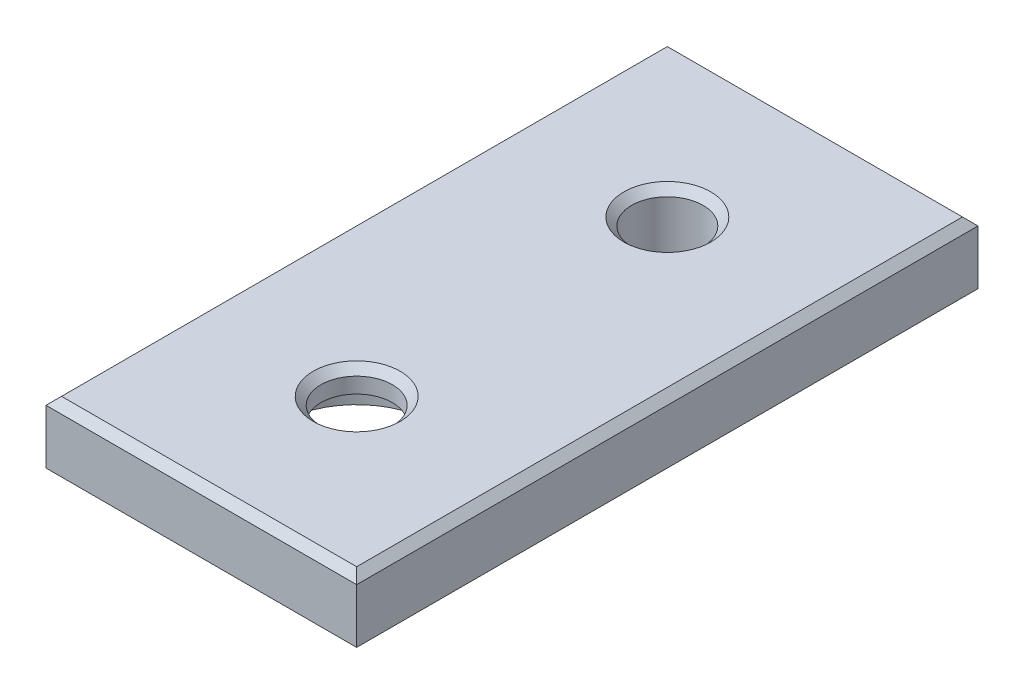
ISO-10303-21;
HEADER;
FILE_DESCRIPTION(('STEP AP214'),'2;1');
FILE_NAME('part.step','',(''),(''),'','','');
FILE_SCHEMA(('AUTOMOTIVE_DESIGN { 1 0 10303 214 1 1 1 1 }'));
ENDSEC;
DATA;
#1=APPLICATION_CONTEXT('core data for automotive mechanical design processes');
#2=APPLICATION_PROTOCOL_DEFINITION('international standard','automotive_design',2000,#1);
#3=PRODUCT_CONTEXT('',#1,'mechanical');
#4=PRODUCT('Part','Part','',(#3));
#5=PRODUCT_RELATED_PRODUCT_CATEGORY('part','',(#4));
#6=PRODUCT_DEFINITION_FORMATION('','',#4);
#7=PRODUCT_DEFINITION_CONTEXT('part definition',#1,'design');
#8=PRODUCT_DEFINITION('design','',#6,#7);
#9=PRODUCT_DEFINITION_SHAPE('','',#8);
#10=(LENGTH_UNIT() NAMED_UNIT(*) SI_UNIT(.MILLI.,.METRE.));
#11=(NAMED_UNIT(*) PLANE_ANGLE_UNIT() SI_UNIT($,.RADIAN.));
#12=(NAMED_UNIT(*) SI_UNIT($,.STERADIAN.) SOLID_ANGLE_UNIT());
#13=UNCERTAINTY_MEASURE_WITH_UNIT(LENGTH_MEASURE(1.E-05),#10,'distance_accuracy_value','');
#14=(GEOMETRIC_REPRESENTATION_CONTEXT(3) GLOBAL_UNCERTAINTY_ASSIGNED_CONTEXT((#13)) GLOBAL_UNIT_ASSIGNED_CONTEXT((#10,
#11,#12)) REPRESENTATION_CONTEXT('',''));
#15=CARTESIAN_POINT('',(0.,0.,0.));
#16=DIRECTION('',(0.,0.,1.));
#17=DIRECTION('',(1.,0.,0.));
#18=AXIS2_PLACEMENT_3D('',#15,#16,#17);
#19=CARTESIAN_POINT('',(0.,0.,10.));
#20=DIRECTION('',(0.,1.,0.));
#21=DIRECTION('',(0.,0.,1.));
#22=AXIS2_PLACEMENT_3D('',#19,#20,#21);
#23=CYLINDRICAL_SURFACE('',#22,2.3);
#24=CARTESIAN_POINT('',(0.,3.50000000000001,10.));
#25=DIRECTION('',(0.,1.,0.));
#26=DIRECTION('',(0.,0.,1.));
#27=AXIS2_PLACEMENT_3D('',#24,#25,#26);
#28=CIRCLE('',#27,2.3);
#29=CARTESIAN_POINT('',(0.,3.50000000000001,12.3));
#30=VERTEX_POINT('',#29);
#31=EDGE_CURVE('E11',#30,#30,#28,.T.);
#32=ORIENTED_EDGE('',*,*,#31,.T.);
#33=EDGE_LOOP('',(#32));
#34=FACE_BOUND('',#33,.T.);
#35=CARTESIAN_POINT('',(0.,2.5,10.));
#36=DIRECTION('',(0.,-1.,0.));
#37=DIRECTION('',(0.,0.,-1.));
#38=AXIS2_PLACEMENT_3D('',#35,#36,#37);
#39=CIRCLE('',#38,2.3);
#40=CARTESIAN_POINT('',(0.,2.5,7.7));
#41=VERTEX_POINT('',#40);
#42=EDGE_CURVE('E40',#41,#41,#39,.F.);
#43=ORIENTED_EDGE('',*,*,#42,.F.);
#44=EDGE_LOOP('',(#43));
#45=FACE_BOUND('',#44,.T.);
#46=ADVANCED_FACE('F36',(#34,#45),#23,.F.);
#47=CARTESIAN_POINT('',(0.,0.,0.));
#48=DIRECTION('',(0.,1.,0.));
#49=DIRECTION('',(0.,0.,1.));
#50=AXIS2_PLACEMENT_3D('',#47,#48,#49);
#51=PLANE('',#50);
#52=CARTESIAN_POINT('',(0.,0.,10.));
#53=DIRECTION('',(0.,-1.,0.));
#54=DIRECTION('',(0.,0.,-1.));
#55=AXIS2_PLACEMENT_3D('',#52,#53,#54);
#56=CIRCLE('',#55,5.);
#57=CARTESIAN_POINT('',(0.,0.,5.));
#58=VERTEX_POINT('',#57);
#59=EDGE_CURVE('E317',#58,#58,#56,.T.);
#60=ORIENTED_EDGE('',*,*,#59,.F.);
#61=EDGE_LOOP('',(#60));
#62=FACE_BOUND('',#61,.T.);
#63=DIRECTION('',(1.,0.,0.));
#64=VECTOR('',#63,1.);
#65=CARTESIAN_POINT('',(0.,0.,-13.));
#66=LINE('',#65,#64);
#67=CARTESIAN_POINT('',(-2.95,0.,-13.));
#68=VERTEX_POINT('',#67);
#69=CARTESIAN_POINT('',(2.95,0.,-13.));
#70=VERTEX_POINT('',#69);
#71=EDGE_CURVE('E172',#68,#70,#66,.T.);
#72=ORIENTED_EDGE('',*,*,#71,.T.);
#73=DIRECTION('',(0.,0.,-1.));
#74=VECTOR('',#73,1.);
#75=CARTESIAN_POINT('',(2.95,0.,0.));
#76=LINE('',#75,#74);
#77=CARTESIAN_POINT('',(2.95,0.,-20.));
#78=VERTEX_POINT('',#77);
#79=EDGE_CURVE('E145',#70,#78,#76,.T.);
#80=ORIENTED_EDGE('',*,*,#79,.T.);
#81=DIRECTION('',(-1.,0.,0.));
#82=VECTOR('',#81,1.);
#83=CARTESIAN_POINT('',(-10.,0.,-20.));
#84=LINE('',#83,#82);
#85=CARTESIAN_POINT('',(10.,0.,-20.));
#86=VERTEX_POINT('',#85);
#87=EDGE_CURVE('E219',#86,#78,#84,.T.);
#88=ORIENTED_EDGE('',*,*,#87,.F.);
#89=DIRECTION('',(0.,0.,-1.));
#90=VECTOR('',#89,1.);
#91=CARTESIAN_POINT('',(10.,0.,-20.));
#92=LINE('',#91,#90);
#93=CARTESIAN_POINT('',(10.,0.,20.));
#94=VERTEX_POINT('',#93);
#95=EDGE_CURVE('E215',#94,#86,#92,.T.);
#96=ORIENTED_EDGE('',*,*,#95,.F.);
#97=DIRECTION('',(1.,0.,0.));
#98=VECTOR('',#97,1.);
#99=CARTESIAN_POINT('',(-10.,0.,20.));
#100=LINE('',#99,#98);
#101=CARTESIAN_POINT('',(-10.,0.,20.));
#102=VERTEX_POINT('',#101);
#103=EDGE_CURVE('E225',#102,#94,#100,.T.);
#104=ORIENTED_EDGE('',*,*,#103,.F.);
#105=DIRECTION('',(0.,0.,1.));
#106=VECTOR('',#105,1.);
#107=CARTESIAN_POINT('',(-10.,0.,-20.));
#108=LINE('',#107,#106);
#109=CARTESIAN_POINT('',(-10.,0.,-20.));
#110=VERTEX_POINT('',#109);
#111=EDGE_CURVE('E222',#110,#102,#108,.T.);
#112=ORIENTED_EDGE('',*,*,#111,.F.);
#113=CARTESIAN_POINT('',(-2.95,0.,-20.));
#114=VERTEX_POINT('',#113);
#115=EDGE_CURVE('E218',#114,#110,#84,.T.);
#116=ORIENTED_EDGE('',*,*,#115,.F.);
#117=DIRECTION('',(0.,0.,-1.));
#118=VECTOR('',#117,1.);
#119=CARTESIAN_POINT('',(-2.95,0.,0.));
#120=LINE('',#119,#118);
#121=EDGE_CURVE('E160',#68,#114,#120,.T.);
#122=ORIENTED_EDGE('',*,*,#121,.F.);
#123=EDGE_LOOP('',(#72,#80,#88,#96,#104,#112,#116,#122));
#124=FACE_BOUND('',#123,.T.);
#125=CARTESIAN_POINT('',(0.,0.,-10.));
#126=DIRECTION('',(0.,1.,0.));
#127=DIRECTION('',(0.,0.,1.));
#128=AXIS2_PLACEMENT_3D('',#125,#126,#127);
#129=CIRCLE('',#128,2.3);
#130=CARTESIAN_POINT('',(0.,0.,-7.7));
#131=VERTEX_POINT('',#130);
#132=EDGE_CURVE('E212',#131,#131,#129,.T.);
#133=ORIENTED_EDGE('',*,*,#132,.T.);
#134=EDGE_LOOP('',(#133));
#135=FACE_BOUND('',#134,.T.);
#136=DIRECTION('',(1.,0.,0.));
#137=VECTOR('',#136,1.);
#138=CARTESIAN_POINT('',(0.,0.,-7.));
#139=LINE('',#138,#137);
#140=CARTESIAN_POINT('',(-2.95,0.,-7.));
#141=VERTEX_POINT('',#140);
#142=CARTESIAN_POINT('',(2.95,0.,-7.));
#143=VERTEX_POINT('',#142);
#144=EDGE_CURVE('E150',#141,#143,#139,.T.);
#145=ORIENTED_EDGE('',*,*,#144,.F.);
#146=DIRECTION('',(0.,0.,1.));
#147=VECTOR('',#146,1.);
#148=CARTESIAN_POINT('',(-2.95,0.,0.));
#149=LINE('',#148,#147);
#150=CARTESIAN_POINT('',(-2.95,0.,-1.));
#151=VERTEX_POINT('',#150);
#152=EDGE_CURVE('E185',#141,#151,#149,.T.);
#153=ORIENTED_EDGE('',*,*,#152,.T.);
#154=DIRECTION('',(1.,0.,0.));
#155=VECTOR('',#154,1.);
#156=CARTESIAN_POINT('',(0.,0.,-1.));
#157=LINE('',#156,#155);
#158=CARTESIAN_POINT('',(2.95,0.,-1.));
#159=VERTEX_POINT('',#158);
#160=EDGE_CURVE('E199',#151,#159,#157,.T.);
#161=ORIENTED_EDGE('',*,*,#160,.T.);
#162=DIRECTION('',(0.,0.,1.));
#163=VECTOR('',#162,1.);
#164=CARTESIAN_POINT('',(2.95,0.,0.));
#165=LINE('',#164,#163);
#166=EDGE_CURVE('E196',#143,#159,#165,.T.);
#167=ORIENTED_EDGE('',*,*,#166,.F.);
#168=EDGE_LOOP('',(#145,#153,#161,#167));
#169=FACE_BOUND('',#168,.T.);
#170=ADVANCED_FACE('F310',(#62,#124,#135,#169),#51,.F.);
#171=CARTESIAN_POINT('',(10.,4.,-20.));
#172=DIRECTION('',(-1.,0.,0.));
#173=DIRECTION('',(0.,0.,1.));
#174=AXIS2_PLACEMENT_3D('',#171,#172,#173);
#175=PLANE('',#174);
#176=DIRECTION('',(0.,-1.,0.));
#177=VECTOR('',#176,1.);
#178=CARTESIAN_POINT('',(10.,4.,-20.));
#179=LINE('',#178,#177);
#180=CARTESIAN_POINT('',(10.,3.50000000000001,-20.));
#181=VERTEX_POINT('',#180);
#182=EDGE_CURVE('E234',#181,#86,#179,.T.);
#183=ORIENTED_EDGE('',*,*,#182,.F.);
#184=DIRECTION('',(0.,0.,1.));
#185=VECTOR('',#184,1.);
#186=CARTESIAN_POINT('',(10.,3.50000000000001,20.));
#187=LINE('',#186,#185);
#188=CARTESIAN_POINT('',(10.,3.50000000000001,20.));
#189=VERTEX_POINT('',#188);
#190=EDGE_CURVE('E256',#181,#189,#187,.T.);
#191=ORIENTED_EDGE('',*,*,#190,.T.);
#192=DIRECTION('',(0.,-1.,0.));
#193=VECTOR('',#192,1.);
#194=CARTESIAN_POINT('',(10.,4.,20.));
#195=LINE('',#194,#193);
#196=EDGE_CURVE('E228',#189,#94,#195,.T.);
#197=ORIENTED_EDGE('',*,*,#196,.T.);
#198=ORIENTED_EDGE('',*,*,#95,.T.);
#199=EDGE_LOOP('',(#183,#191,#197,#198));
#200=FACE_BOUND('',#199,.T.);
#201=ADVANCED_FACE('F283',(#200),#175,.F.);
#202=CARTESIAN_POINT('',(-10.,4.,-20.));
#203=DIRECTION('',(0.,0.,1.));
#204=DIRECTION('',(1.,0.,0.));
#205=AXIS2_PLACEMENT_3D('',#202,#203,#204);
#206=PLANE('',#205);
#207=DIRECTION('',(0.,-1.,0.));
#208=VECTOR('',#207,1.);
#209=CARTESIAN_POINT('',(-10.,4.,-20.));
#210=LINE('',#209,#208);
#211=CARTESIAN_POINT('',(-10.,3.50000000000001,-20.));
#212=VERTEX_POINT('',#211);
#213=EDGE_CURVE('E232',#212,#110,#210,.T.);
#214=ORIENTED_EDGE('',*,*,#213,.F.);
#215=DIRECTION('',(1.,0.,0.));
#216=VECTOR('',#215,1.);
#217=CARTESIAN_POINT('',(10.,3.50000000000001,-20.));
#218=LINE('',#217,#216);
#219=EDGE_CURVE('E53',#212,#181,#218,.T.);
#220=ORIENTED_EDGE('',*,*,#219,.T.);
#221=ORIENTED_EDGE('',*,*,#182,.T.);
#222=ORIENTED_EDGE('',*,*,#87,.T.);
#223=DIRECTION('',(0.,1.,0.));
#224=VECTOR('',#223,1.);
#225=CARTESIAN_POINT('',(2.95,-2.,-20.));
#226=LINE('',#225,#224);
#227=CARTESIAN_POINT('',(2.95,-2.,-20.));
#228=VERTEX_POINT('',#227);
#229=EDGE_CURVE('E170',#228,#78,#226,.T.);
#230=ORIENTED_EDGE('',*,*,#229,.F.);
#231=DIRECTION('',(1.,0.,0.));
#232=VECTOR('',#231,1.);
#233=CARTESIAN_POINT('',(0.,-2.,-20.));
#234=LINE('',#233,#232);
#235=CARTESIAN_POINT('',(-2.95,-2.,-20.));
#236=VERTEX_POINT('',#235);
#237=EDGE_CURVE('E158',#236,#228,#234,.T.);
#238=ORIENTED_EDGE('',*,*,#237,.F.);
#239=DIRECTION('',(0.,1.,0.));
#240=VECTOR('',#239,1.);
#241=CARTESIAN_POINT('',(-2.95,-2.,-20.));
#242=LINE('',#241,#240);
#243=EDGE_CURVE('E178',#236,#114,#242,.T.);
#244=ORIENTED_EDGE('',*,*,#243,.T.);
#245=ORIENTED_EDGE('',*,*,#115,.T.);
#246=EDGE_LOOP('',(#214,#220,#221,#222,#230,#238,#244,#245));
#247=FACE_BOUND('',#246,.T.);
#248=ADVANCED_FACE('F369',(#247),#206,.F.);
#249=CARTESIAN_POINT('',(-10.,4.,-20.));
#250=DIRECTION('',(1.,0.,0.));
#251=DIRECTION('',(0.,0.,-1.));
#252=AXIS2_PLACEMENT_3D('',#249,#250,#251);
#253=PLANE('',#252);
#254=DIRECTION('',(0.,-1.,0.));
#255=VECTOR('',#254,1.);
#256=CARTESIAN_POINT('',(-10.,4.,20.));
#257=LINE('',#256,#255);
#258=CARTESIAN_POINT('',(-10.,3.50000000000001,20.));
#259=VERTEX_POINT('',#258);
#260=EDGE_CURVE('E230',#259,#102,#257,.T.);
#261=ORIENTED_EDGE('',*,*,#260,.F.);
#262=DIRECTION('',(0.,0.,-1.));
#263=VECTOR('',#262,1.);
#264=CARTESIAN_POINT('',(-10.,3.50000000000001,-20.));
#265=LINE('',#264,#263);
#266=EDGE_CURVE('E61',#259,#212,#265,.T.);
#267=ORIENTED_EDGE('',*,*,#266,.T.);
#268=ORIENTED_EDGE('',*,*,#213,.T.);
#269=ORIENTED_EDGE('',*,*,#111,.T.);
#270=EDGE_LOOP('',(#261,#267,#268,#269));
#271=FACE_BOUND('',#270,.T.);
#272=ADVANCED_FACE('F366',(#271),#253,.F.);
#273=CARTESIAN_POINT('',(-10.,4.,20.));
#274=DIRECTION('',(0.,0.,-1.));
#275=DIRECTION('',(-1.,0.,0.));
#276=AXIS2_PLACEMENT_3D('',#273,#274,#275);
#277=PLANE('',#276);
#278=ORIENTED_EDGE('',*,*,#196,.F.);
#279=DIRECTION('',(-1.,0.,0.));
#280=VECTOR('',#279,1.);
#281=CARTESIAN_POINT('',(-10.,3.50000000000001,20.));
#282=LINE('',#281,#280);
#283=EDGE_CURVE('E251',#189,#259,#282,.T.);
#284=ORIENTED_EDGE('',*,*,#283,.T.);
#285=ORIENTED_EDGE('',*,*,#260,.T.);
#286=ORIENTED_EDGE('',*,*,#103,.T.);
#287=EDGE_LOOP('',(#278,#284,#285,#286));
#288=FACE_BOUND('',#287,.T.);
#289=ADVANCED_FACE('F286',(#288),#277,.F.);
#290=CARTESIAN_POINT('',(0.,4.,0.));
#291=DIRECTION('',(0.,1.,0.));
#292=DIRECTION('',(0.,0.,1.));
#293=AXIS2_PLACEMENT_3D('',#290,#291,#292);
#294=PLANE('',#293);
#295=DIRECTION('',(0.,0.,1.));
#296=VECTOR('',#295,1.);
#297=CARTESIAN_POINT('',(-9.5,4.,20.));
#298=LINE('',#297,#296);
#299=CARTESIAN_POINT('',(-9.50000000000001,4.,-19.5));
#300=VERTEX_POINT('',#299);
#301=CARTESIAN_POINT('',(-9.5,4.,19.5));
#302=VERTEX_POINT('',#301);
#303=EDGE_CURVE('E246',#300,#302,#298,.T.);
#304=ORIENTED_EDGE('',*,*,#303,.T.);
#305=DIRECTION('',(1.,0.,0.));
#306=VECTOR('',#305,1.);
#307=CARTESIAN_POINT('',(10.,4.,19.5));
#308=LINE('',#307,#306);
#309=CARTESIAN_POINT('',(9.50000000000001,4.,19.5));
#310=VERTEX_POINT('',#309);
#311=EDGE_CURVE('E248',#302,#310,#308,.T.);
#312=ORIENTED_EDGE('',*,*,#311,.T.);
#313=DIRECTION('',(0.,0.,-1.));
#314=VECTOR('',#313,1.);
#315=CARTESIAN_POINT('',(9.50000000000001,4.,-20.));
#316=LINE('',#315,#314);
#317=CARTESIAN_POINT('',(9.50000000000001,4.,-19.5));
#318=VERTEX_POINT('',#317);
#319=EDGE_CURVE('E242',#310,#318,#316,.T.);
#320=ORIENTED_EDGE('',*,*,#319,.T.);
#321=DIRECTION('',(-1.,0.,0.));
#322=VECTOR('',#321,1.);
#323=CARTESIAN_POINT('',(-10.,4.,-19.5));
#324=LINE('',#323,#322);
#325=EDGE_CURVE('E244',#318,#300,#324,.T.);
#326=ORIENTED_EDGE('',*,*,#325,.T.);
#327=EDGE_LOOP('',(#304,#312,#320,#326));
#328=FACE_BOUND('',#327,.T.);
#329=CARTESIAN_POINT('',(0.,4.,-10.));
#330=DIRECTION('',(0.,1.,0.));
#331=DIRECTION('',(0.,0.,1.));
#332=AXIS2_PLACEMENT_3D('',#329,#330,#331);
#333=CIRCLE('',#332,2.8);
#334=CARTESIAN_POINT('',(0.,4.,-7.20000000000001));
#335=VERTEX_POINT('',#334);
#336=EDGE_CURVE('E239',#335,#335,#333,.F.);
#337=ORIENTED_EDGE('',*,*,#336,.T.);
#338=EDGE_LOOP('',(#337));
#339=FACE_BOUND('',#338,.T.);
#340=CARTESIAN_POINT('',(0.,4.,10.));
#341=DIRECTION('',(0.,1.,0.));
#342=DIRECTION('',(0.,0.,1.));
#343=AXIS2_PLACEMENT_3D('',#340,#341,#342);
#344=CIRCLE('',#343,2.79999999999999);
#345=CARTESIAN_POINT('',(0.,4.,12.8));
#346=VERTEX_POINT('',#345);
#347=EDGE_CURVE('E236',#346,#346,#344,.F.);
#348=ORIENTED_EDGE('',*,*,#347,.T.);
#349=EDGE_LOOP('',(#348));
#350=FACE_BOUND('',#349,.T.);
#351=ADVANCED_FACE('F293',(#328,#339,#350),#294,.T.);
#352=CARTESIAN_POINT('',(0.,0.,-10.));
#353=DIRECTION('',(0.,1.,0.));
#354=DIRECTION('',(0.,0.,1.));
#355=AXIS2_PLACEMENT_3D('',#352,#353,#354);
#356=CYLINDRICAL_SURFACE('',#355,2.3);
#357=CARTESIAN_POINT('',(0.,3.5,-10.));
#358=DIRECTION('',(0.,1.,0.));
#359=DIRECTION('',(0.,0.,1.));
#360=AXIS2_PLACEMENT_3D('',#357,#358,#359);
#361=CIRCLE('',#360,2.3);
#362=CARTESIAN_POINT('',(0.,3.5,-7.7));
#363=VERTEX_POINT('',#362);
#364=EDGE_CURVE('E45',#363,#363,#361,.T.);
#365=ORIENTED_EDGE('',*,*,#364,.T.);
#366=EDGE_LOOP('',(#365));
#367=FACE_BOUND('',#366,.T.);
#368=ORIENTED_EDGE('',*,*,#132,.F.);
#369=EDGE_LOOP('',(#368));
#370=FACE_BOUND('',#369,.T.);
#371=ADVANCED_FACE('F296',(#367,#370),#356,.F.);
#372=CARTESIAN_POINT('',(0.,-2.,-7.));
#373=DIRECTION('',(0.,0.,1.));
#374=DIRECTION('',(1.,0.,0.));
#375=AXIS2_PLACEMENT_3D('',#372,#373,#374);
#376=PLANE('',#375);
#377=ORIENTED_EDGE('',*,*,#144,.T.);
#378=DIRECTION('',(0.,1.,0.));
#379=VECTOR('',#378,1.);
#380=CARTESIAN_POINT('',(2.95,-2.,-7.));
#381=LINE('',#380,#379);
#382=CARTESIAN_POINT('',(2.95,-2.,-7.));
#383=VERTEX_POINT('',#382);
#384=EDGE_CURVE('E210',#383,#143,#381,.T.);
#385=ORIENTED_EDGE('',*,*,#384,.F.);
#386=DIRECTION('',(1.,0.,0.));
#387=VECTOR('',#386,1.);
#388=CARTESIAN_POINT('',(0.,-2.,-7.));
#389=LINE('',#388,#387);
#390=CARTESIAN_POINT('',(-2.95,-2.,-7.));
#391=VERTEX_POINT('',#390);
#392=EDGE_CURVE('E181',#391,#383,#389,.T.);
#393=ORIENTED_EDGE('',*,*,#392,.F.);
#394=DIRECTION('',(0.,1.,0.));
#395=VECTOR('',#394,1.);
#396=CARTESIAN_POINT('',(-2.95,-2.,-7.));
#397=LINE('',#396,#395);
#398=EDGE_CURVE('E193',#391,#141,#397,.T.);
#399=ORIENTED_EDGE('',*,*,#398,.T.);
#400=EDGE_LOOP('',(#377,#385,#393,#399));
#401=FACE_BOUND('',#400,.T.);
#402=ADVANCED_FACE('F338',(#401),#376,.F.);
#403=CARTESIAN_POINT('',(2.95,-2.,0.));
#404=DIRECTION('',(-1.,0.,0.));
#405=DIRECTION('',(0.,0.,1.));
#406=AXIS2_PLACEMENT_3D('',#403,#404,#405);
#407=PLANE('',#406);
#408=ORIENTED_EDGE('',*,*,#166,.T.);
#409=DIRECTION('',(0.,1.,0.));
#410=VECTOR('',#409,1.);
#411=CARTESIAN_POINT('',(2.95,-2.,-1.));
#412=LINE('',#411,#410);
#413=CARTESIAN_POINT('',(2.95,-2.,-1.));
#414=VERTEX_POINT('',#413);
#415=EDGE_CURVE('E208',#414,#159,#412,.T.);
#416=ORIENTED_EDGE('',*,*,#415,.F.);
#417=DIRECTION('',(0.,0.,1.));
#418=VECTOR('',#417,1.);
#419=CARTESIAN_POINT('',(2.95,-2.,0.));
#420=LINE('',#419,#418);
#421=EDGE_CURVE('E184',#383,#414,#420,.T.);
#422=ORIENTED_EDGE('',*,*,#421,.F.);
#423=ORIENTED_EDGE('',*,*,#384,.T.);
#424=EDGE_LOOP('',(#408,#416,#422,#423));
#425=FACE_BOUND('',#424,.T.);
#426=ADVANCED_FACE('F350',(#425),#407,.F.);
#427=CARTESIAN_POINT('',(0.,-2.,-1.));
#428=DIRECTION('',(0.,0.,1.));
#429=DIRECTION('',(1.,0.,0.));
#430=AXIS2_PLACEMENT_3D('',#427,#428,#429);
#431=PLANE('',#430);
#432=ORIENTED_EDGE('',*,*,#160,.F.);
#433=DIRECTION('',(0.,1.,0.));
#434=VECTOR('',#433,1.);
#435=CARTESIAN_POINT('',(-2.95,-2.,-1.));
#436=LINE('',#435,#434);
#437=CARTESIAN_POINT('',(-2.95,-2.,-1.));
#438=VERTEX_POINT('',#437);
#439=EDGE_CURVE('E205',#438,#151,#436,.T.);
#440=ORIENTED_EDGE('',*,*,#439,.F.);
#441=DIRECTION('',(1.,0.,0.));
#442=VECTOR('',#441,1.);
#443=CARTESIAN_POINT('',(0.,-2.,-1.));
#444=LINE('',#443,#442);
#445=EDGE_CURVE('E187',#438,#414,#444,.T.);
#446=ORIENTED_EDGE('',*,*,#445,.T.);
#447=ORIENTED_EDGE('',*,*,#415,.T.);
#448=EDGE_LOOP('',(#432,#440,#446,#447));
#449=FACE_BOUND('',#448,.T.);
#450=ADVANCED_FACE('F345',(#449),#431,.T.);
#451=CARTESIAN_POINT('',(-2.95,-2.,0.));
#452=DIRECTION('',(-1.,0.,0.));
#453=DIRECTION('',(0.,0.,1.));
#454=AXIS2_PLACEMENT_3D('',#451,#452,#453);
#455=PLANE('',#454);
#456=ORIENTED_EDGE('',*,*,#152,.F.);
#457=ORIENTED_EDGE('',*,*,#398,.F.);
#458=DIRECTION('',(0.,0.,1.));
#459=VECTOR('',#458,1.);
#460=CARTESIAN_POINT('',(-2.95,-2.,0.));
#461=LINE('',#460,#459);
#462=EDGE_CURVE('E190',#391,#438,#461,.T.);
#463=ORIENTED_EDGE('',*,*,#462,.T.);
#464=ORIENTED_EDGE('',*,*,#439,.T.);
#465=EDGE_LOOP('',(#456,#457,#463,#464));
#466=FACE_BOUND('',#465,.T.);
#467=ADVANCED_FACE('F342',(#466),#455,.T.);
#468=CARTESIAN_POINT('',(0.,-2.,0.));
#469=DIRECTION('',(0.,-1.,0.));
#470=DIRECTION('',(0.,0.,-1.));
#471=AXIS2_PLACEMENT_3D('',#468,#469,#470);
#472=PLANE('',#471);
#473=ORIENTED_EDGE('',*,*,#392,.T.);
#474=ORIENTED_EDGE('',*,*,#421,.T.);
#475=ORIENTED_EDGE('',*,*,#445,.F.);
#476=ORIENTED_EDGE('',*,*,#462,.F.);
#477=EDGE_LOOP('',(#473,#474,#475,#476));
#478=FACE_BOUND('',#477,.T.);
#479=ADVANCED_FACE('F347',(#478),#472,.T.);
#480=CARTESIAN_POINT('',(2.95,-2.,0.));
#481=DIRECTION('',(1.,0.,0.));
#482=DIRECTION('',(0.,0.,-1.));
#483=AXIS2_PLACEMENT_3D('',#480,#481,#482);
#484=PLANE('',#483);
#485=ORIENTED_EDGE('',*,*,#79,.F.);
#486=DIRECTION('',(0.,1.,0.));
#487=VECTOR('',#486,1.);
#488=CARTESIAN_POINT('',(2.95,-2.,-13.));
#489=LINE('',#488,#487);
#490=CARTESIAN_POINT('',(2.95,-2.,-13.));
#491=VERTEX_POINT('',#490);
#492=EDGE_CURVE('E140',#491,#70,#489,.T.);
#493=ORIENTED_EDGE('',*,*,#492,.F.);
#494=DIRECTION('',(0.,0.,-1.));
#495=VECTOR('',#494,1.);
#496=CARTESIAN_POINT('',(2.95,-2.,0.));
#497=LINE('',#496,#495);
#498=EDGE_CURVE('E143',#491,#228,#497,.T.);
#499=ORIENTED_EDGE('',*,*,#498,.T.);
#500=ORIENTED_EDGE('',*,*,#229,.T.);
#501=EDGE_LOOP('',(#485,#493,#499,#500));
#502=FACE_BOUND('',#501,.T.);
#503=ADVANCED_FACE('F142',(#502),#484,.T.);
#504=CARTESIAN_POINT('',(0.,-2.,-13.));
#505=DIRECTION('',(0.,0.,1.));
#506=DIRECTION('',(1.,0.,0.));
#507=AXIS2_PLACEMENT_3D('',#504,#505,#506);
#508=PLANE('',#507);
#509=ORIENTED_EDGE('',*,*,#71,.F.);
#510=DIRECTION('',(0.,1.,0.));
#511=VECTOR('',#510,1.);
#512=CARTESIAN_POINT('',(-2.95,-2.,-13.));
#513=LINE('',#512,#511);
#514=CARTESIAN_POINT('',(-2.95,-2.,-13.));
#515=VERTEX_POINT('',#514);
#516=EDGE_CURVE('E151',#515,#68,#513,.T.);
#517=ORIENTED_EDGE('',*,*,#516,.F.);
#518=DIRECTION('',(1.,0.,0.));
#519=VECTOR('',#518,1.);
#520=CARTESIAN_POINT('',(0.,-2.,-13.));
#521=LINE('',#520,#519);
#522=EDGE_CURVE('E156',#515,#491,#521,.T.);
#523=ORIENTED_EDGE('',*,*,#522,.T.);
#524=ORIENTED_EDGE('',*,*,#492,.T.);
#525=EDGE_LOOP('',(#509,#517,#523,#524));
#526=FACE_BOUND('',#525,.T.);
#527=ADVANCED_FACE('F162',(#526),#508,.T.);
#528=CARTESIAN_POINT('',(-2.95,-2.,0.));
#529=DIRECTION('',(1.,0.,0.));
#530=DIRECTION('',(0.,0.,-1.));
#531=AXIS2_PLACEMENT_3D('',#528,#529,#530);
#532=PLANE('',#531);
#533=ORIENTED_EDGE('',*,*,#121,.T.);
#534=ORIENTED_EDGE('',*,*,#243,.F.);
#535=DIRECTION('',(0.,0.,-1.));
#536=VECTOR('',#535,1.);
#537=CARTESIAN_POINT('',(-2.95,-2.,0.));
#538=LINE('',#537,#536);
#539=EDGE_CURVE('E164',#515,#236,#538,.T.);
#540=ORIENTED_EDGE('',*,*,#539,.F.);
#541=ORIENTED_EDGE('',*,*,#516,.T.);
#542=EDGE_LOOP('',(#533,#534,#540,#541));
#543=FACE_BOUND('',#542,.T.);
#544=ADVANCED_FACE('F421',(#543),#532,.F.);
#545=CARTESIAN_POINT('',(0.,-2.,0.));
#546=DIRECTION('',(0.,-1.,0.));
#547=DIRECTION('',(0.,0.,-1.));
#548=AXIS2_PLACEMENT_3D('',#545,#546,#547);
#549=PLANE('',#548);
#550=ORIENTED_EDGE('',*,*,#498,.F.);
#551=ORIENTED_EDGE('',*,*,#522,.F.);
#552=ORIENTED_EDGE('',*,*,#539,.T.);
#553=ORIENTED_EDGE('',*,*,#237,.T.);
#554=EDGE_LOOP('',(#550,#551,#552,#553));
#555=FACE_BOUND('',#554,.T.);
#556=ADVANCED_FACE('F155',(#555),#549,.T.);
#557=CARTESIAN_POINT('',(0.,4.,-19.5));
#558=DIRECTION('',(0.,0.707106781186547,-0.707106781186547));
#559=DIRECTION('',(1.,0.,0.));
#560=AXIS2_PLACEMENT_3D('',#557,#558,#559);
#561=PLANE('',#560);
#562=DIRECTION('',(-0.577350269189625,0.577350269189626,0.577350269189626));
#563=VECTOR('',#562,1.);
#564=CARTESIAN_POINT('',(3.00000000000001,10.5,-13.));
#565=LINE('',#564,#563);
#566=EDGE_CURVE('E264',#181,#318,#565,.T.);
#567=ORIENTED_EDGE('',*,*,#566,.F.);
#568=ORIENTED_EDGE('',*,*,#219,.F.);
#569=DIRECTION('',(0.577350269189627,0.577350269189625,0.577350269189625));
#570=VECTOR('',#569,1.);
#571=CARTESIAN_POINT('',(-6.33333333333333,7.16666666666667,-16.3333333333333));
#572=LINE('',#571,#570);
#573=EDGE_CURVE('E173',#300,#212,#572,.F.);
#574=ORIENTED_EDGE('',*,*,#573,.F.);
#575=ORIENTED_EDGE('',*,*,#325,.F.);
#576=EDGE_LOOP('',(#567,#568,#574,#575));
#577=FACE_BOUND('',#576,.T.);
#578=ADVANCED_FACE('F275',(#577),#561,.T.);
#579=CARTESIAN_POINT('',(-9.50000000000001,4.,0.));
#580=DIRECTION('',(-0.707106781186547,0.707106781186548,0.));
#581=DIRECTION('',(0.,0.,-1.));
#582=AXIS2_PLACEMENT_3D('',#579,#580,#581);
#583=PLANE('',#582);
#584=ORIENTED_EDGE('',*,*,#573,.T.);
#585=ORIENTED_EDGE('',*,*,#266,.F.);
#586=DIRECTION('',(0.577350269189626,0.577350269189626,-0.577350269189625));
#587=VECTOR('',#586,1.);
#588=CARTESIAN_POINT('',(-3.,10.5,13.));
#589=LINE('',#588,#587);
#590=EDGE_CURVE('E262',#302,#259,#589,.F.);
#591=ORIENTED_EDGE('',*,*,#590,.F.);
#592=ORIENTED_EDGE('',*,*,#303,.F.);
#593=EDGE_LOOP('',(#584,#585,#591,#592));
#594=FACE_BOUND('',#593,.T.);
#595=ADVANCED_FACE('F270',(#594),#583,.T.);
#596=CARTESIAN_POINT('',(9.50000000000001,4.,0.));
#597=DIRECTION('',(0.707106781186548,0.707106781186547,0.));
#598=DIRECTION('',(0.,0.,1.));
#599=AXIS2_PLACEMENT_3D('',#596,#597,#598);
#600=PLANE('',#599);
#601=ORIENTED_EDGE('',*,*,#566,.T.);
#602=ORIENTED_EDGE('',*,*,#319,.F.);
#603=DIRECTION('',(0.577350269189625,-0.577350269189626,0.577350269189626));
#604=VECTOR('',#603,1.);
#605=CARTESIAN_POINT('',(3.00000000000001,10.5,13.));
#606=LINE('',#605,#604);
#607=EDGE_CURVE('E260',#189,#310,#606,.F.);
#608=ORIENTED_EDGE('',*,*,#607,.F.);
#609=ORIENTED_EDGE('',*,*,#190,.F.);
#610=EDGE_LOOP('',(#601,#602,#608,#609));
#611=FACE_BOUND('',#610,.T.);
#612=ADVANCED_FACE('F280',(#611),#600,.T.);
#613=CARTESIAN_POINT('',(0.,4.,19.5));
#614=DIRECTION('',(0.,0.707106781186547,0.707106781186547));
#615=DIRECTION('',(-1.,0.,0.));
#616=AXIS2_PLACEMENT_3D('',#613,#614,#615);
#617=PLANE('',#616);
#618=ORIENTED_EDGE('',*,*,#590,.T.);
#619=ORIENTED_EDGE('',*,*,#283,.F.);
#620=ORIENTED_EDGE('',*,*,#607,.T.);
#621=ORIENTED_EDGE('',*,*,#311,.F.);
#622=EDGE_LOOP('',(#618,#619,#620,#621));
#623=FACE_BOUND('',#622,.T.);
#624=ADVANCED_FACE('F290',(#623),#617,.T.);
#625=CARTESIAN_POINT('',(0.,3.5,-10.));
#626=DIRECTION('',(0.,1.,0.));
#627=DIRECTION('',(0.,0.,1.));
#628=AXIS2_PLACEMENT_3D('',#625,#626,#627);
#629=CONICAL_SURFACE('',#628,2.3,0.785398163397447);
#630=ORIENTED_EDGE('',*,*,#336,.F.);
#631=EDGE_LOOP('',(#630));
#632=FACE_BOUND('',#631,.T.);
#633=ORIENTED_EDGE('',*,*,#364,.F.);
#634=EDGE_LOOP('',(#633));
#635=FACE_BOUND('',#634,.T.);
#636=ADVANCED_FACE('F305',(#632,#635),#629,.F.);
#637=CARTESIAN_POINT('',(0.,3.50000000000001,10.));
#638=DIRECTION('',(0.,1.,0.));
#639=DIRECTION('',(0.,0.,1.));
#640=AXIS2_PLACEMENT_3D('',#637,#638,#639);
#641=CONICAL_SURFACE('',#640,2.3,0.785398163397447);
#642=ORIENTED_EDGE('',*,*,#347,.F.);
#643=EDGE_LOOP('',(#642));
#644=FACE_BOUND('',#643,.T.);
#645=ORIENTED_EDGE('',*,*,#31,.F.);
#646=EDGE_LOOP('',(#645));
#647=FACE_BOUND('',#646,.T.);
#648=ADVANCED_FACE('F38',(#644,#647),#641,.F.);
#649=CARTESIAN_POINT('',(0.,2.5,10.));
#650=DIRECTION('',(0.,-1.,0.));
#651=DIRECTION('',(0.,0.,-1.));
#652=AXIS2_PLACEMENT_3D('',#649,#650,#651);
#653=PLANE('',#652);
#654=CARTESIAN_POINT('',(0.,2.5,10.));
#655=DIRECTION('',(0.,-1.,0.));
#656=DIRECTION('',(0.,0.,-1.));
#657=AXIS2_PLACEMENT_3D('',#654,#655,#656);
#658=CIRCLE('',#657,5.);
#659=CARTESIAN_POINT('',(0.,2.5,5.));
#660=VERTEX_POINT('',#659);
#661=EDGE_CURVE('E315',#660,#660,#658,.T.);
#662=ORIENTED_EDGE('',*,*,#661,.T.);
#663=EDGE_LOOP('',(#662));
#664=FACE_BOUND('',#663,.T.);
#665=ORIENTED_EDGE('',*,*,#42,.T.);
#666=EDGE_LOOP('',(#665));
#667=FACE_BOUND('',#666,.T.);
#668=ADVANCED_FACE('F304',(#664,#667),#653,.T.);
#669=CARTESIAN_POINT('',(0.,2.5,10.));
#670=DIRECTION('',(0.,-1.,0.));
#671=DIRECTION('',(0.,0.,-1.));
#672=AXIS2_PLACEMENT_3D('',#669,#670,#671);
#673=CYLINDRICAL_SURFACE('',#672,5.);
#674=ORIENTED_EDGE('',*,*,#661,.F.);
#675=EDGE_LOOP('',(#674));
#676=FACE_BOUND('',#675,.T.);
#677=ORIENTED_EDGE('',*,*,#59,.T.);
#678=EDGE_LOOP('',(#677));
#679=FACE_BOUND('',#678,.T.);
#680=ADVANCED_FACE('F324',(#676,#679),#673,.F.);
#681=CLOSED_SHELL('',(#46,#170,#201,#248,#272,#289,#351,#371,#402,#426,#450,#467,#479,#503,#527,
#544,#556,#578,#595,#612,#624,#636,#648,#668,#680));
#682=MANIFOLD_SOLID_BREP('B2',#681);
#683=ADVANCED_BREP_SHAPE_REPRESENTATION('',(#18,#682),#14);
#684=SHAPE_DEFINITION_REPRESENTATION(#9,#683);
ENDSEC;
END-ISO-10303-21;
